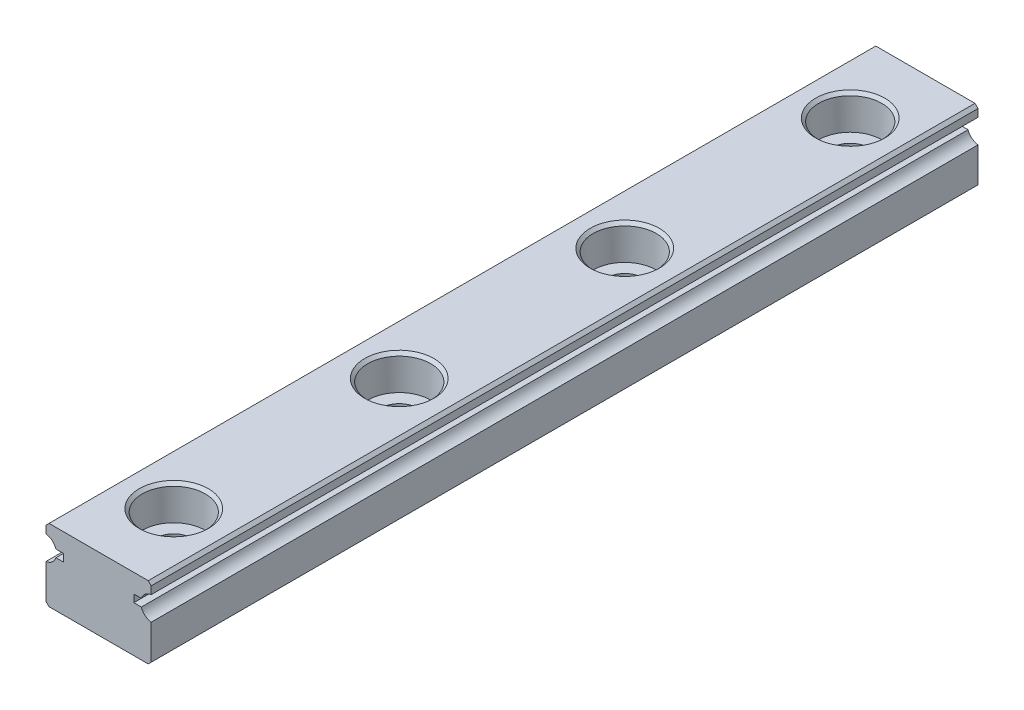
ISO-10303-21;
HEADER;
FILE_DESCRIPTION(('STEP AP214'),'2;1');
FILE_NAME('part.step','',(''),(''),'','','');
FILE_SCHEMA(('AUTOMOTIVE_DESIGN { 1 0 10303 214 1 1 1 1 }'));
ENDSEC;
DATA;
#1=APPLICATION_CONTEXT('core data for automotive mechanical design processes');
#2=APPLICATION_PROTOCOL_DEFINITION('international standard','automotive_design',2000,#1);
#3=PRODUCT_CONTEXT('',#1,'mechanical');
#4=PRODUCT('Part','Part','',(#3));
#5=PRODUCT_RELATED_PRODUCT_CATEGORY('part','',(#4));
#6=PRODUCT_DEFINITION_FORMATION('','',#4);
#7=PRODUCT_DEFINITION_CONTEXT('part definition',#1,'design');
#8=PRODUCT_DEFINITION('design','',#6,#7);
#9=PRODUCT_DEFINITION_SHAPE('','',#8);
#10=(LENGTH_UNIT() NAMED_UNIT(*) SI_UNIT(.MILLI.,.METRE.));
#11=(NAMED_UNIT(*) PLANE_ANGLE_UNIT() SI_UNIT($,.RADIAN.));
#12=(NAMED_UNIT(*) SI_UNIT($,.STERADIAN.) SOLID_ANGLE_UNIT());
#13=UNCERTAINTY_MEASURE_WITH_UNIT(LENGTH_MEASURE(1.E-05),#10,'distance_accuracy_value','');
#14=(GEOMETRIC_REPRESENTATION_CONTEXT(3) GLOBAL_UNCERTAINTY_ASSIGNED_CONTEXT((#13)) GLOBAL_UNIT_ASSIGNED_CONTEXT((#10,
#11,#12)) REPRESENTATION_CONTEXT('',''));
#15=CARTESIAN_POINT('',(0.,0.,0.));
#16=DIRECTION('',(0.,0.,1.));
#17=DIRECTION('',(1.,0.,0.));
#18=AXIS2_PLACEMENT_3D('',#15,#16,#17);
#19=CARTESIAN_POINT('',(0.,-2.401,50.));
#20=DIRECTION('',(0.,1.,0.));
#21=DIRECTION('',(0.,0.,1.));
#22=AXIS2_PLACEMENT_3D('',#19,#20,#21);
#23=CYLINDRICAL_SURFACE('',#22,1.2);
#24=CARTESIAN_POINT('',(0.,-2.2,50.));
#25=DIRECTION('',(0.,1.,0.));
#26=DIRECTION('',(0.,0.,1.));
#27=AXIS2_PLACEMENT_3D('',#24,#25,#26);
#28=CIRCLE('',#27,1.2);
#29=CARTESIAN_POINT('',(0.,-2.2,51.2));
#30=VERTEX_POINT('',#29);
#31=EDGE_CURVE('E332',#30,#30,#28,.F.);
#32=ORIENTED_EDGE('',*,*,#31,.T.);
#33=EDGE_LOOP('',(#32));
#34=FACE_BOUND('',#33,.T.);
#35=CARTESIAN_POINT('',(0.,0.0999999999999994,50.));
#36=DIRECTION('',(0.,1.,0.));
#37=DIRECTION('',(0.,0.,1.));
#38=AXIS2_PLACEMENT_3D('',#35,#36,#37);
#39=CIRCLE('',#38,1.2);
#40=CARTESIAN_POINT('',(0.,0.0999999999999994,51.2));
#41=VERTEX_POINT('',#40);
#42=EDGE_CURVE('E628',#41,#41,#39,.T.);
#43=ORIENTED_EDGE('',*,*,#42,.T.);
#44=EDGE_LOOP('',(#43));
#45=FACE_BOUND('',#44,.T.);
#46=ADVANCED_FACE('F36',(#34,#45),#23,.F.);
#47=CARTESIAN_POINT('',(0.,-2.401,35.));
#48=DIRECTION('',(0.,1.,0.));
#49=DIRECTION('',(0.,0.,1.));
#50=AXIS2_PLACEMENT_3D('',#47,#48,#49);
#51=CYLINDRICAL_SURFACE('',#50,1.2);
#52=CARTESIAN_POINT('',(0.,-2.2,35.));
#53=DIRECTION('',(0.,1.,0.));
#54=DIRECTION('',(0.,0.,1.));
#55=AXIS2_PLACEMENT_3D('',#52,#53,#54);
#56=CIRCLE('',#55,1.2);
#57=CARTESIAN_POINT('',(0.,-2.2,36.2));
#58=VERTEX_POINT('',#57);
#59=EDGE_CURVE('E320',#58,#58,#56,.F.);
#60=ORIENTED_EDGE('',*,*,#59,.T.);
#61=EDGE_LOOP('',(#60));
#62=FACE_BOUND('',#61,.T.);
#63=CARTESIAN_POINT('',(0.,0.0999999999999994,35.));
#64=DIRECTION('',(0.,1.,0.));
#65=DIRECTION('',(0.,0.,1.));
#66=AXIS2_PLACEMENT_3D('',#63,#64,#65);
#67=CIRCLE('',#66,1.2);
#68=CARTESIAN_POINT('',(0.,0.0999999999999994,36.2));
#69=VERTEX_POINT('',#68);
#70=EDGE_CURVE('E503',#69,#69,#67,.T.);
#71=ORIENTED_EDGE('',*,*,#70,.T.);
#72=EDGE_LOOP('',(#71));
#73=FACE_BOUND('',#72,.T.);
#74=ADVANCED_FACE('F353',(#62,#73),#51,.F.);
#75=CARTESIAN_POINT('',(0.,-2.401,20.));
#76=DIRECTION('',(0.,1.,0.));
#77=DIRECTION('',(0.,0.,1.));
#78=AXIS2_PLACEMENT_3D('',#75,#76,#77);
#79=CYLINDRICAL_SURFACE('',#78,1.2);
#80=CARTESIAN_POINT('',(0.,-2.2,20.));
#81=DIRECTION('',(0.,1.,0.));
#82=DIRECTION('',(0.,0.,1.));
#83=AXIS2_PLACEMENT_3D('',#80,#81,#82);
#84=CIRCLE('',#83,1.2);
#85=CARTESIAN_POINT('',(0.,-2.2,21.2));
#86=VERTEX_POINT('',#85);
#87=EDGE_CURVE('E308',#86,#86,#84,.F.);
#88=ORIENTED_EDGE('',*,*,#87,.T.);
#89=EDGE_LOOP('',(#88));
#90=FACE_BOUND('',#89,.T.);
#91=CARTESIAN_POINT('',(0.,0.0999999999999994,20.));
#92=DIRECTION('',(0.,1.,0.));
#93=DIRECTION('',(0.,0.,1.));
#94=AXIS2_PLACEMENT_3D('',#91,#92,#93);
#95=CIRCLE('',#94,1.2);
#96=CARTESIAN_POINT('',(0.,0.0999999999999994,21.2));
#97=VERTEX_POINT('',#96);
#98=EDGE_CURVE('E502',#97,#97,#95,.T.);
#99=ORIENTED_EDGE('',*,*,#98,.T.);
#100=EDGE_LOOP('',(#99));
#101=FACE_BOUND('',#100,.T.);
#102=ADVANCED_FACE('F359',(#90,#101),#79,.F.);
#103=CARTESIAN_POINT('',(0.,-2.401,5.));
#104=DIRECTION('',(0.,1.,0.));
#105=DIRECTION('',(0.,0.,1.));
#106=AXIS2_PLACEMENT_3D('',#103,#104,#105);
#107=CYLINDRICAL_SURFACE('',#106,1.2);
#108=CARTESIAN_POINT('',(0.,-2.2,5.));
#109=DIRECTION('',(0.,1.,0.));
#110=DIRECTION('',(0.,0.,1.));
#111=AXIS2_PLACEMENT_3D('',#108,#109,#110);
#112=CIRCLE('',#111,1.2);
#113=CARTESIAN_POINT('',(0.,-2.2,6.2));
#114=VERTEX_POINT('',#113);
#115=EDGE_CURVE('E296',#114,#114,#112,.F.);
#116=ORIENTED_EDGE('',*,*,#115,.T.);
#117=EDGE_LOOP('',(#116));
#118=FACE_BOUND('',#117,.T.);
#119=CARTESIAN_POINT('',(0.,0.0999999999999994,5.));
#120=DIRECTION('',(0.,1.,0.));
#121=DIRECTION('',(0.,0.,1.));
#122=AXIS2_PLACEMENT_3D('',#119,#120,#121);
#123=CIRCLE('',#122,1.2);
#124=CARTESIAN_POINT('',(0.,0.0999999999999994,6.2));
#125=VERTEX_POINT('',#124);
#126=EDGE_CURVE('E515',#125,#125,#123,.T.);
#127=ORIENTED_EDGE('',*,*,#126,.T.);
#128=EDGE_LOOP('',(#127));
#129=FACE_BOUND('',#128,.T.);
#130=ADVANCED_FACE('F369',(#118,#129),#107,.F.);
#131=CARTESIAN_POINT('',(-3.6,0.899999999999999,55.));
#132=DIRECTION('',(0.,0.,-1.));
#133=DIRECTION('',(-1.,0.,0.));
#134=AXIS2_PLACEMENT_3D('',#131,#132,#133);
#135=CYLINDRICAL_SURFACE('',#134,0.800000000000001);
#136=CARTESIAN_POINT('',(-3.6,0.899999999999999,0.));
#137=DIRECTION('',(0.,0.,-1.));
#138=DIRECTION('',(-1.,0.,0.));
#139=AXIS2_PLACEMENT_3D('',#136,#137,#138);
#140=CIRCLE('',#139,0.800000000000001);
#141=CARTESIAN_POINT('',(-3.5,1.69372539331938,0.));
#142=VERTEX_POINT('',#141);
#143=CARTESIAN_POINT('',(-2.84006579232147,1.15,0.));
#144=VERTEX_POINT('',#143);
#145=EDGE_CURVE('E206',#142,#144,#140,.T.);
#146=ORIENTED_EDGE('',*,*,#145,.T.);
#147=DIRECTION('',(0.,0.,-1.));
#148=VECTOR('',#147,1.);
#149=CARTESIAN_POINT('',(-2.84006579232147,1.15,55.));
#150=LINE('',#149,#148);
#151=CARTESIAN_POINT('',(-2.84006579232147,1.15,55.));
#152=VERTEX_POINT('',#151);
#153=EDGE_CURVE('E294',#152,#144,#150,.T.);
#154=ORIENTED_EDGE('',*,*,#153,.F.);
#155=CARTESIAN_POINT('',(-3.6,0.899999999999999,55.));
#156=DIRECTION('',(0.,0.,-1.));
#157=DIRECTION('',(-1.,0.,0.));
#158=AXIS2_PLACEMENT_3D('',#155,#156,#157);
#159=CIRCLE('',#158,0.800000000000001);
#160=CARTESIAN_POINT('',(-3.5,1.69372539331938,55.));
#161=VERTEX_POINT('',#160);
#162=EDGE_CURVE('E245',#161,#152,#159,.T.);
#163=ORIENTED_EDGE('',*,*,#162,.F.);
#164=DIRECTION('',(0.,0.,-1.));
#165=VECTOR('',#164,1.);
#166=CARTESIAN_POINT('',(-3.5,1.69372539331938,55.));
#167=LINE('',#166,#165);
#168=EDGE_CURVE('E202',#161,#142,#167,.T.);
#169=ORIENTED_EDGE('',*,*,#168,.T.);
#170=EDGE_LOOP('',(#146,#154,#163,#169));
#171=FACE_BOUND('',#170,.T.);
#172=ADVANCED_FACE('F383',(#171),#135,.F.);
#173=CARTESIAN_POINT('',(-2.84006579232147,1.15,55.));
#174=DIRECTION('',(0.,1.,0.));
#175=DIRECTION('',(-1.,0.,0.));
#176=AXIS2_PLACEMENT_3D('',#173,#174,#175);
#177=PLANE('',#176);
#178=DIRECTION('',(1.,0.,0.));
#179=VECTOR('',#178,1.);
#180=CARTESIAN_POINT('',(-2.84006579232147,1.15,0.));
#181=LINE('',#180,#179);
#182=CARTESIAN_POINT('',(-2.34006579232147,1.15,0.));
#183=VERTEX_POINT('',#182);
#184=EDGE_CURVE('E209',#144,#183,#181,.T.);
#185=ORIENTED_EDGE('',*,*,#184,.T.);
#186=DIRECTION('',(0.,0.,-1.));
#187=VECTOR('',#186,1.);
#188=CARTESIAN_POINT('',(-2.34006579232147,1.15,55.));
#189=LINE('',#188,#187);
#190=CARTESIAN_POINT('',(-2.34006579232147,1.15,55.));
#191=VERTEX_POINT('',#190);
#192=EDGE_CURVE('E291',#191,#183,#189,.T.);
#193=ORIENTED_EDGE('',*,*,#192,.F.);
#194=DIRECTION('',(1.,0.,0.));
#195=VECTOR('',#194,1.);
#196=CARTESIAN_POINT('',(-2.84006579232147,1.15,55.));
#197=LINE('',#196,#195);
#198=EDGE_CURVE('E133',#152,#191,#197,.T.);
#199=ORIENTED_EDGE('',*,*,#198,.F.);
#200=ORIENTED_EDGE('',*,*,#153,.T.);
#201=EDGE_LOOP('',(#185,#193,#199,#200));
#202=FACE_BOUND('',#201,.T.);
#203=ADVANCED_FACE('F457',(#202),#177,.F.);
#204=CARTESIAN_POINT('',(-2.34006579232147,0.649999999999998,55.));
#205=DIRECTION('',(1.,0.,0.));
#206=DIRECTION('',(0.,0.,-1.));
#207=AXIS2_PLACEMENT_3D('',#204,#205,#206);
#208=PLANE('',#207);
#209=DIRECTION('',(0.,-1.,0.));
#210=VECTOR('',#209,1.);
#211=CARTESIAN_POINT('',(-2.34006579232147,0.649999999999998,0.));
#212=LINE('',#211,#210);
#213=CARTESIAN_POINT('',(-2.34006579232147,0.649999999999998,0.));
#214=VERTEX_POINT('',#213);
#215=EDGE_CURVE('E212',#183,#214,#212,.T.);
#216=ORIENTED_EDGE('',*,*,#215,.T.);
#217=DIRECTION('',(0.,0.,-1.));
#218=VECTOR('',#217,1.);
#219=CARTESIAN_POINT('',(-2.34006579232147,0.649999999999998,55.));
#220=LINE('',#219,#218);
#221=CARTESIAN_POINT('',(-2.34006579232147,0.649999999999998,55.));
#222=VERTEX_POINT('',#221);
#223=EDGE_CURVE('E288',#222,#214,#220,.T.);
#224=ORIENTED_EDGE('',*,*,#223,.F.);
#225=DIRECTION('',(0.,-1.,0.));
#226=VECTOR('',#225,1.);
#227=CARTESIAN_POINT('',(-2.34006579232147,0.649999999999998,55.));
#228=LINE('',#227,#226);
#229=EDGE_CURVE('E522',#191,#222,#228,.T.);
#230=ORIENTED_EDGE('',*,*,#229,.F.);
#231=ORIENTED_EDGE('',*,*,#192,.T.);
#232=EDGE_LOOP('',(#216,#224,#230,#231));
#233=FACE_BOUND('',#232,.T.);
#234=ADVANCED_FACE('F453',(#233),#208,.F.);
#235=CARTESIAN_POINT('',(-2.84006579232147,0.649999999999999,55.));
#236=DIRECTION('',(0.,-1.,0.));
#237=DIRECTION('',(1.,0.,0.));
#238=AXIS2_PLACEMENT_3D('',#235,#236,#237);
#239=PLANE('',#238);
#240=DIRECTION('',(-1.,0.,0.));
#241=VECTOR('',#240,1.);
#242=CARTESIAN_POINT('',(-2.84006579232147,0.649999999999999,0.));
#243=LINE('',#242,#241);
#244=CARTESIAN_POINT('',(-2.84006579232147,0.65,0.));
#245=VERTEX_POINT('',#244);
#246=EDGE_CURVE('E214',#214,#245,#243,.T.);
#247=ORIENTED_EDGE('',*,*,#246,.T.);
#248=DIRECTION('',(0.,0.,-1.));
#249=VECTOR('',#248,1.);
#250=CARTESIAN_POINT('',(-2.84006579232147,0.65,55.));
#251=LINE('',#250,#249);
#252=CARTESIAN_POINT('',(-2.84006579232147,0.65,55.));
#253=VERTEX_POINT('',#252);
#254=EDGE_CURVE('E285',#253,#245,#251,.T.);
#255=ORIENTED_EDGE('',*,*,#254,.F.);
#256=DIRECTION('',(-1.,0.,0.));
#257=VECTOR('',#256,1.);
#258=CARTESIAN_POINT('',(-2.84006579232147,0.649999999999999,55.));
#259=LINE('',#258,#257);
#260=EDGE_CURVE('E524',#222,#253,#259,.T.);
#261=ORIENTED_EDGE('',*,*,#260,.F.);
#262=ORIENTED_EDGE('',*,*,#223,.T.);
#263=EDGE_LOOP('',(#247,#255,#261,#262));
#264=FACE_BOUND('',#263,.T.);
#265=ADVANCED_FACE('F449',(#264),#239,.F.);
#266=CARTESIAN_POINT('',(-3.6,0.899999999999999,55.));
#267=DIRECTION('',(0.,0.,-1.));
#268=DIRECTION('',(-1.,0.,0.));
#269=AXIS2_PLACEMENT_3D('',#266,#267,#268);
#270=CYLINDRICAL_SURFACE('',#269,0.800000000000001);
#271=CARTESIAN_POINT('',(-3.6,0.899999999999999,0.));
#272=DIRECTION('',(0.,0.,-1.));
#273=DIRECTION('',(-1.,0.,0.));
#274=AXIS2_PLACEMENT_3D('',#271,#272,#273);
#275=CIRCLE('',#274,0.800000000000001);
#276=CARTESIAN_POINT('',(-3.5,0.106274606680622,0.));
#277=VERTEX_POINT('',#276);
#278=EDGE_CURVE('E216',#245,#277,#275,.T.);
#279=ORIENTED_EDGE('',*,*,#278,.T.);
#280=DIRECTION('',(0.,0.,-1.));
#281=VECTOR('',#280,1.);
#282=CARTESIAN_POINT('',(-3.5,0.106274606680622,55.));
#283=LINE('',#282,#281);
#284=CARTESIAN_POINT('',(-3.5,0.106274606680622,55.));
#285=VERTEX_POINT('',#284);
#286=EDGE_CURVE('E282',#285,#277,#283,.T.);
#287=ORIENTED_EDGE('',*,*,#286,.F.);
#288=CARTESIAN_POINT('',(-3.6,0.899999999999999,55.));
#289=DIRECTION('',(0.,0.,-1.));
#290=DIRECTION('',(-1.,0.,0.));
#291=AXIS2_PLACEMENT_3D('',#288,#289,#290);
#292=CIRCLE('',#291,0.800000000000001);
#293=EDGE_CURVE('E526',#253,#285,#292,.T.);
#294=ORIENTED_EDGE('',*,*,#293,.F.);
#295=ORIENTED_EDGE('',*,*,#254,.T.);
#296=EDGE_LOOP('',(#279,#287,#294,#295));
#297=FACE_BOUND('',#296,.T.);
#298=ADVANCED_FACE('F445',(#297),#270,.F.);
#299=CARTESIAN_POINT('',(-3.5,-2.2,55.));
#300=DIRECTION('',(1.,0.,0.));
#301=DIRECTION('',(0.,1.,0.));
#302=AXIS2_PLACEMENT_3D('',#299,#300,#301);
#303=PLANE('',#302);
#304=DIRECTION('',(0.,-1.,0.));
#305=VECTOR('',#304,1.);
#306=CARTESIAN_POINT('',(-3.5,-2.2,0.));
#307=LINE('',#306,#305);
#308=CARTESIAN_POINT('',(-3.5,-2.2,0.));
#309=VERTEX_POINT('',#308);
#310=EDGE_CURVE('E218',#277,#309,#307,.T.);
#311=ORIENTED_EDGE('',*,*,#310,.T.);
#312=DIRECTION('',(0.,0.,-1.));
#313=VECTOR('',#312,1.);
#314=CARTESIAN_POINT('',(-3.5,-2.2,55.));
#315=LINE('',#314,#313);
#316=CARTESIAN_POINT('',(-3.5,-2.2,55.));
#317=VERTEX_POINT('',#316);
#318=EDGE_CURVE('E279',#317,#309,#315,.T.);
#319=ORIENTED_EDGE('',*,*,#318,.F.);
#320=DIRECTION('',(0.,-1.,0.));
#321=VECTOR('',#320,1.);
#322=CARTESIAN_POINT('',(-3.5,-2.2,55.));
#323=LINE('',#322,#321);
#324=EDGE_CURVE('E528',#285,#317,#323,.T.);
#325=ORIENTED_EDGE('',*,*,#324,.F.);
#326=ORIENTED_EDGE('',*,*,#286,.T.);
#327=EDGE_LOOP('',(#311,#319,#325,#326));
#328=FACE_BOUND('',#327,.T.);
#329=ADVANCED_FACE('F441',(#328),#303,.F.);
#330=CARTESIAN_POINT('',(-3.5,-2.2,55.));
#331=DIRECTION('',(0.707106781186548,0.707106781186548,0.));
#332=DIRECTION('',(-0.707106781186548,0.707106781186548,0.));
#333=AXIS2_PLACEMENT_3D('',#330,#331,#332);
#334=PLANE('',#333);
#335=DIRECTION('',(0.707106781186548,-0.707106781186548,0.));
#336=VECTOR('',#335,1.);
#337=CARTESIAN_POINT('',(-3.5,-2.2,0.));
#338=LINE('',#337,#336);
#339=CARTESIAN_POINT('',(-3.3,-2.4,0.));
#340=VERTEX_POINT('',#339);
#341=EDGE_CURVE('E220',#309,#340,#338,.T.);
#342=ORIENTED_EDGE('',*,*,#341,.T.);
#343=DIRECTION('',(0.,0.,-1.));
#344=VECTOR('',#343,1.);
#345=CARTESIAN_POINT('',(-3.3,-2.4,55.));
#346=LINE('',#345,#344);
#347=CARTESIAN_POINT('',(-3.3,-2.4,55.));
#348=VERTEX_POINT('',#347);
#349=EDGE_CURVE('E276',#348,#340,#346,.T.);
#350=ORIENTED_EDGE('',*,*,#349,.F.);
#351=DIRECTION('',(0.707106781186548,-0.707106781186548,0.));
#352=VECTOR('',#351,1.);
#353=CARTESIAN_POINT('',(-3.5,-2.2,55.));
#354=LINE('',#353,#352);
#355=EDGE_CURVE('E530',#317,#348,#354,.T.);
#356=ORIENTED_EDGE('',*,*,#355,.F.);
#357=ORIENTED_EDGE('',*,*,#318,.T.);
#358=EDGE_LOOP('',(#342,#350,#356,#357));
#359=FACE_BOUND('',#358,.T.);
#360=ADVANCED_FACE('F437',(#359),#334,.F.);
#361=CARTESIAN_POINT('',(-3.3,-2.4,55.));
#362=DIRECTION('',(0.,1.,0.));
#363=DIRECTION('',(0.,0.,1.));
#364=AXIS2_PLACEMENT_3D('',#361,#362,#363);
#365=PLANE('',#364);
#366=CARTESIAN_POINT('',(0.,-2.4,50.));
#367=DIRECTION('',(0.,1.,0.));
#368=DIRECTION('',(0.,0.,1.));
#369=AXIS2_PLACEMENT_3D('',#366,#367,#368);
#370=CIRCLE('',#369,1.4);
#371=CARTESIAN_POINT('',(0.,-2.4,51.4));
#372=VERTEX_POINT('',#371);
#373=EDGE_CURVE('E335',#372,#372,#370,.T.);
#374=ORIENTED_EDGE('',*,*,#373,.T.);
#375=EDGE_LOOP('',(#374));
#376=FACE_BOUND('',#375,.T.);
#377=CARTESIAN_POINT('',(0.,-2.4,35.));
#378=DIRECTION('',(0.,1.,0.));
#379=DIRECTION('',(0.,0.,1.));
#380=AXIS2_PLACEMENT_3D('',#377,#378,#379);
#381=CIRCLE('',#380,1.4);
#382=CARTESIAN_POINT('',(0.,-2.4,36.4));
#383=VERTEX_POINT('',#382);
#384=EDGE_CURVE('E323',#383,#383,#381,.T.);
#385=ORIENTED_EDGE('',*,*,#384,.T.);
#386=EDGE_LOOP('',(#385));
#387=FACE_BOUND('',#386,.T.);
#388=CARTESIAN_POINT('',(0.,-2.4,20.));
#389=DIRECTION('',(0.,1.,0.));
#390=DIRECTION('',(0.,0.,1.));
#391=AXIS2_PLACEMENT_3D('',#388,#389,#390);
#392=CIRCLE('',#391,1.4);
#393=CARTESIAN_POINT('',(0.,-2.4,21.4));
#394=VERTEX_POINT('',#393);
#395=EDGE_CURVE('E311',#394,#394,#392,.T.);
#396=ORIENTED_EDGE('',*,*,#395,.T.);
#397=EDGE_LOOP('',(#396));
#398=FACE_BOUND('',#397,.T.);
#399=CARTESIAN_POINT('',(0.,-2.4,5.));
#400=DIRECTION('',(0.,1.,0.));
#401=DIRECTION('',(0.,0.,1.));
#402=AXIS2_PLACEMENT_3D('',#399,#400,#401);
#403=CIRCLE('',#402,1.4);
#404=CARTESIAN_POINT('',(0.,-2.4,6.4));
#405=VERTEX_POINT('',#404);
#406=EDGE_CURVE('E299',#405,#405,#403,.T.);
#407=ORIENTED_EDGE('',*,*,#406,.T.);
#408=EDGE_LOOP('',(#407));
#409=FACE_BOUND('',#408,.T.);
#410=DIRECTION('',(1.,0.,0.));
#411=VECTOR('',#410,1.);
#412=CARTESIAN_POINT('',(-3.3,-2.4,0.));
#413=LINE('',#412,#411);
#414=CARTESIAN_POINT('',(3.3,-2.4,0.));
#415=VERTEX_POINT('',#414);
#416=EDGE_CURVE('E222',#340,#415,#413,.T.);
#417=ORIENTED_EDGE('',*,*,#416,.T.);
#418=DIRECTION('',(0.,0.,-1.));
#419=VECTOR('',#418,1.);
#420=CARTESIAN_POINT('',(3.3,-2.4,55.));
#421=LINE('',#420,#419);
#422=CARTESIAN_POINT('',(3.3,-2.4,55.));
#423=VERTEX_POINT('',#422);
#424=EDGE_CURVE('E273',#423,#415,#421,.T.);
#425=ORIENTED_EDGE('',*,*,#424,.F.);
#426=DIRECTION('',(1.,0.,0.));
#427=VECTOR('',#426,1.);
#428=CARTESIAN_POINT('',(-3.3,-2.4,55.));
#429=LINE('',#428,#427);
#430=EDGE_CURVE('E532',#348,#423,#429,.T.);
#431=ORIENTED_EDGE('',*,*,#430,.F.);
#432=ORIENTED_EDGE('',*,*,#349,.T.);
#433=EDGE_LOOP('',(#417,#425,#431,#432));
#434=FACE_BOUND('',#433,.T.);
#435=ADVANCED_FACE('F433',(#376,#387,#398,#409,#434),#365,.F.);
#436=CARTESIAN_POINT('',(3.3,-2.4,55.));
#437=DIRECTION('',(-0.707106781186548,0.707106781186548,0.));
#438=DIRECTION('',(-0.707106781186548,-0.707106781186548,0.));
#439=AXIS2_PLACEMENT_3D('',#436,#437,#438);
#440=PLANE('',#439);
#441=DIRECTION('',(0.707106781186548,0.707106781186548,0.));
#442=VECTOR('',#441,1.);
#443=CARTESIAN_POINT('',(3.3,-2.4,0.));
#444=LINE('',#443,#442);
#445=CARTESIAN_POINT('',(3.5,-2.2,0.));
#446=VERTEX_POINT('',#445);
#447=EDGE_CURVE('E224',#415,#446,#444,.T.);
#448=ORIENTED_EDGE('',*,*,#447,.T.);
#449=DIRECTION('',(0.,0.,-1.));
#450=VECTOR('',#449,1.);
#451=CARTESIAN_POINT('',(3.5,-2.2,55.));
#452=LINE('',#451,#450);
#453=CARTESIAN_POINT('',(3.5,-2.2,55.));
#454=VERTEX_POINT('',#453);
#455=EDGE_CURVE('E270',#454,#446,#452,.T.);
#456=ORIENTED_EDGE('',*,*,#455,.F.);
#457=DIRECTION('',(0.707106781186548,0.707106781186548,0.));
#458=VECTOR('',#457,1.);
#459=CARTESIAN_POINT('',(3.3,-2.4,55.));
#460=LINE('',#459,#458);
#461=EDGE_CURVE('E534',#423,#454,#460,.T.);
#462=ORIENTED_EDGE('',*,*,#461,.F.);
#463=ORIENTED_EDGE('',*,*,#424,.T.);
#464=EDGE_LOOP('',(#448,#456,#462,#463));
#465=FACE_BOUND('',#464,.T.);
#466=ADVANCED_FACE('F429',(#465),#440,.F.);
#467=CARTESIAN_POINT('',(3.5,-2.2,55.));
#468=DIRECTION('',(-1.,0.,0.));
#469=DIRECTION('',(0.,-1.,0.));
#470=AXIS2_PLACEMENT_3D('',#467,#468,#469);
#471=PLANE('',#470);
#472=DIRECTION('',(0.,1.,0.));
#473=VECTOR('',#472,1.);
#474=CARTESIAN_POINT('',(3.5,-2.2,0.));
#475=LINE('',#474,#473);
#476=CARTESIAN_POINT('',(3.5,0.106274606680621,0.));
#477=VERTEX_POINT('',#476);
#478=EDGE_CURVE('E226',#446,#477,#475,.T.);
#479=ORIENTED_EDGE('',*,*,#478,.T.);
#480=DIRECTION('',(0.,0.,-1.));
#481=VECTOR('',#480,1.);
#482=CARTESIAN_POINT('',(3.5,0.106274606680621,55.));
#483=LINE('',#482,#481);
#484=CARTESIAN_POINT('',(3.5,0.106274606680621,55.));
#485=VERTEX_POINT('',#484);
#486=EDGE_CURVE('E267',#485,#477,#483,.T.);
#487=ORIENTED_EDGE('',*,*,#486,.F.);
#488=DIRECTION('',(0.,1.,0.));
#489=VECTOR('',#488,1.);
#490=CARTESIAN_POINT('',(3.5,-2.2,55.));
#491=LINE('',#490,#489);
#492=EDGE_CURVE('E536',#454,#485,#491,.T.);
#493=ORIENTED_EDGE('',*,*,#492,.F.);
#494=ORIENTED_EDGE('',*,*,#455,.T.);
#495=EDGE_LOOP('',(#479,#487,#493,#494));
#496=FACE_BOUND('',#495,.T.);
#497=ADVANCED_FACE('F425',(#496),#471,.F.);
#498=CARTESIAN_POINT('',(3.6,0.899999999999999,55.));
#499=DIRECTION('',(0.,0.,-1.));
#500=DIRECTION('',(-1.,0.,0.));
#501=AXIS2_PLACEMENT_3D('',#498,#499,#500);
#502=CYLINDRICAL_SURFACE('',#501,0.800000000000001);
#503=CARTESIAN_POINT('',(3.6,0.899999999999999,0.));
#504=DIRECTION('',(0.,0.,-1.));
#505=DIRECTION('',(1.,0.,0.));
#506=AXIS2_PLACEMENT_3D('',#503,#504,#505);
#507=CIRCLE('',#506,0.800000000000001);
#508=CARTESIAN_POINT('',(2.84006579232146,0.649999999999999,0.));
#509=VERTEX_POINT('',#508);
#510=EDGE_CURVE('E228',#477,#509,#507,.T.);
#511=ORIENTED_EDGE('',*,*,#510,.T.);
#512=DIRECTION('',(0.,0.,-1.));
#513=VECTOR('',#512,1.);
#514=CARTESIAN_POINT('',(2.84006579232146,0.649999999999999,55.));
#515=LINE('',#514,#513);
#516=CARTESIAN_POINT('',(2.84006579232146,0.649999999999999,55.));
#517=VERTEX_POINT('',#516);
#518=EDGE_CURVE('E264',#517,#509,#515,.T.);
#519=ORIENTED_EDGE('',*,*,#518,.F.);
#520=CARTESIAN_POINT('',(3.6,0.899999999999999,55.));
#521=DIRECTION('',(0.,0.,-1.));
#522=DIRECTION('',(1.,0.,0.));
#523=AXIS2_PLACEMENT_3D('',#520,#521,#522);
#524=CIRCLE('',#523,0.800000000000001);
#525=EDGE_CURVE('E538',#485,#517,#524,.T.);
#526=ORIENTED_EDGE('',*,*,#525,.F.);
#527=ORIENTED_EDGE('',*,*,#486,.T.);
#528=EDGE_LOOP('',(#511,#519,#526,#527));
#529=FACE_BOUND('',#528,.T.);
#530=ADVANCED_FACE('F421',(#529),#502,.F.);
#531=CARTESIAN_POINT('',(2.84006579232146,0.649999999999999,55.));
#532=DIRECTION('',(0.,-1.,0.));
#533=DIRECTION('',(1.,0.,0.));
#534=AXIS2_PLACEMENT_3D('',#531,#532,#533);
#535=PLANE('',#534);
#536=DIRECTION('',(-1.,0.,0.));
#537=VECTOR('',#536,1.);
#538=CARTESIAN_POINT('',(2.84006579232146,0.649999999999999,0.));
#539=LINE('',#538,#537);
#540=CARTESIAN_POINT('',(2.34006579232147,0.649999999999998,0.));
#541=VERTEX_POINT('',#540);
#542=EDGE_CURVE('E230',#509,#541,#539,.T.);
#543=ORIENTED_EDGE('',*,*,#542,.T.);
#544=DIRECTION('',(0.,0.,-1.));
#545=VECTOR('',#544,1.);
#546=CARTESIAN_POINT('',(2.34006579232147,0.649999999999998,55.));
#547=LINE('',#546,#545);
#548=CARTESIAN_POINT('',(2.34006579232147,0.649999999999998,55.));
#549=VERTEX_POINT('',#548);
#550=EDGE_CURVE('E261',#549,#541,#547,.T.);
#551=ORIENTED_EDGE('',*,*,#550,.F.);
#552=DIRECTION('',(-1.,0.,0.));
#553=VECTOR('',#552,1.);
#554=CARTESIAN_POINT('',(2.84006579232146,0.649999999999999,55.));
#555=LINE('',#554,#553);
#556=EDGE_CURVE('E540',#517,#549,#555,.T.);
#557=ORIENTED_EDGE('',*,*,#556,.F.);
#558=ORIENTED_EDGE('',*,*,#518,.T.);
#559=EDGE_LOOP('',(#543,#551,#557,#558));
#560=FACE_BOUND('',#559,.T.);
#561=ADVANCED_FACE('F417',(#560),#535,.F.);
#562=CARTESIAN_POINT('',(2.34006579232147,0.649999999999998,55.));
#563=DIRECTION('',(-1.,0.,0.));
#564=DIRECTION('',(0.,0.,1.));
#565=AXIS2_PLACEMENT_3D('',#562,#563,#564);
#566=PLANE('',#565);
#567=DIRECTION('',(0.,1.,0.));
#568=VECTOR('',#567,1.);
#569=CARTESIAN_POINT('',(2.34006579232147,0.649999999999998,0.));
#570=LINE('',#569,#568);
#571=CARTESIAN_POINT('',(2.34006579232147,1.15,0.));
#572=VERTEX_POINT('',#571);
#573=EDGE_CURVE('E232',#541,#572,#570,.T.);
#574=ORIENTED_EDGE('',*,*,#573,.T.);
#575=DIRECTION('',(0.,0.,-1.));
#576=VECTOR('',#575,1.);
#577=CARTESIAN_POINT('',(2.34006579232147,1.15,55.));
#578=LINE('',#577,#576);
#579=CARTESIAN_POINT('',(2.34006579232147,1.15,55.));
#580=VERTEX_POINT('',#579);
#581=EDGE_CURVE('E258',#580,#572,#578,.T.);
#582=ORIENTED_EDGE('',*,*,#581,.F.);
#583=DIRECTION('',(0.,1.,0.));
#584=VECTOR('',#583,1.);
#585=CARTESIAN_POINT('',(2.34006579232147,0.649999999999998,55.));
#586=LINE('',#585,#584);
#587=EDGE_CURVE('E542',#549,#580,#586,.T.);
#588=ORIENTED_EDGE('',*,*,#587,.F.);
#589=ORIENTED_EDGE('',*,*,#550,.T.);
#590=EDGE_LOOP('',(#574,#582,#588,#589));
#591=FACE_BOUND('',#590,.T.);
#592=ADVANCED_FACE('F413',(#591),#566,.F.);
#593=CARTESIAN_POINT('',(2.84006579232146,1.15,55.));
#594=DIRECTION('',(0.,1.,0.));
#595=DIRECTION('',(-1.,0.,0.));
#596=AXIS2_PLACEMENT_3D('',#593,#594,#595);
#597=PLANE('',#596);
#598=DIRECTION('',(1.,0.,0.));
#599=VECTOR('',#598,1.);
#600=CARTESIAN_POINT('',(2.84006579232146,1.15,0.));
#601=LINE('',#600,#599);
#602=CARTESIAN_POINT('',(2.84006579232147,1.15,0.));
#603=VERTEX_POINT('',#602);
#604=EDGE_CURVE('E234',#572,#603,#601,.T.);
#605=ORIENTED_EDGE('',*,*,#604,.T.);
#606=DIRECTION('',(0.,0.,-1.));
#607=VECTOR('',#606,1.);
#608=CARTESIAN_POINT('',(2.84006579232147,1.15,55.));
#609=LINE('',#608,#607);
#610=CARTESIAN_POINT('',(2.84006579232147,1.15,55.));
#611=VERTEX_POINT('',#610);
#612=EDGE_CURVE('E255',#611,#603,#609,.T.);
#613=ORIENTED_EDGE('',*,*,#612,.F.);
#614=DIRECTION('',(1.,0.,0.));
#615=VECTOR('',#614,1.);
#616=CARTESIAN_POINT('',(2.84006579232146,1.15,55.));
#617=LINE('',#616,#615);
#618=EDGE_CURVE('E544',#580,#611,#617,.T.);
#619=ORIENTED_EDGE('',*,*,#618,.F.);
#620=ORIENTED_EDGE('',*,*,#581,.T.);
#621=EDGE_LOOP('',(#605,#613,#619,#620));
#622=FACE_BOUND('',#621,.T.);
#623=ADVANCED_FACE('F409',(#622),#597,.F.);
#624=CARTESIAN_POINT('',(3.6,0.899999999999999,55.));
#625=DIRECTION('',(0.,0.,-1.));
#626=DIRECTION('',(-1.,0.,0.));
#627=AXIS2_PLACEMENT_3D('',#624,#625,#626);
#628=CYLINDRICAL_SURFACE('',#627,0.800000000000001);
#629=CARTESIAN_POINT('',(3.6,0.899999999999999,0.));
#630=DIRECTION('',(0.,0.,-1.));
#631=DIRECTION('',(1.,0.,0.));
#632=AXIS2_PLACEMENT_3D('',#629,#630,#631);
#633=CIRCLE('',#632,0.800000000000001);
#634=CARTESIAN_POINT('',(3.5,1.69372539331938,0.));
#635=VERTEX_POINT('',#634);
#636=EDGE_CURVE('E236',#603,#635,#633,.T.);
#637=ORIENTED_EDGE('',*,*,#636,.T.);
#638=DIRECTION('',(0.,0.,-1.));
#639=VECTOR('',#638,1.);
#640=CARTESIAN_POINT('',(3.5,1.69372539331938,55.));
#641=LINE('',#640,#639);
#642=CARTESIAN_POINT('',(3.5,1.69372539331938,55.));
#643=VERTEX_POINT('',#642);
#644=EDGE_CURVE('E252',#643,#635,#641,.T.);
#645=ORIENTED_EDGE('',*,*,#644,.F.);
#646=CARTESIAN_POINT('',(3.6,0.899999999999999,55.));
#647=DIRECTION('',(0.,0.,-1.));
#648=DIRECTION('',(1.,0.,0.));
#649=AXIS2_PLACEMENT_3D('',#646,#647,#648);
#650=CIRCLE('',#649,0.800000000000001);
#651=EDGE_CURVE('E546',#611,#643,#650,.T.);
#652=ORIENTED_EDGE('',*,*,#651,.F.);
#653=ORIENTED_EDGE('',*,*,#612,.T.);
#654=EDGE_LOOP('',(#637,#645,#652,#653));
#655=FACE_BOUND('',#654,.T.);
#656=ADVANCED_FACE('F405',(#655),#628,.F.);
#657=CARTESIAN_POINT('',(3.5,1.69372539331938,55.));
#658=DIRECTION('',(-1.,0.,0.));
#659=DIRECTION('',(0.,-1.,0.));
#660=AXIS2_PLACEMENT_3D('',#657,#658,#659);
#661=PLANE('',#660);
#662=DIRECTION('',(0.,1.,0.));
#663=VECTOR('',#662,1.);
#664=CARTESIAN_POINT('',(3.5,1.69372539331938,0.));
#665=LINE('',#664,#663);
#666=CARTESIAN_POINT('',(3.5,2.2,0.));
#667=VERTEX_POINT('',#666);
#668=EDGE_CURVE('E238',#635,#667,#665,.T.);
#669=ORIENTED_EDGE('',*,*,#668,.T.);
#670=DIRECTION('',(0.,0.,-1.));
#671=VECTOR('',#670,1.);
#672=CARTESIAN_POINT('',(3.5,2.2,55.));
#673=LINE('',#672,#671);
#674=CARTESIAN_POINT('',(3.5,2.2,55.));
#675=VERTEX_POINT('',#674);
#676=EDGE_CURVE('E249',#675,#667,#673,.T.);
#677=ORIENTED_EDGE('',*,*,#676,.F.);
#678=DIRECTION('',(0.,1.,0.));
#679=VECTOR('',#678,1.);
#680=CARTESIAN_POINT('',(3.5,1.69372539331938,55.));
#681=LINE('',#680,#679);
#682=EDGE_CURVE('E548',#643,#675,#681,.T.);
#683=ORIENTED_EDGE('',*,*,#682,.F.);
#684=ORIENTED_EDGE('',*,*,#644,.T.);
#685=EDGE_LOOP('',(#669,#677,#683,#684));
#686=FACE_BOUND('',#685,.T.);
#687=ADVANCED_FACE('F401',(#686),#661,.F.);
#688=CARTESIAN_POINT('',(3.3,2.4,55.));
#689=DIRECTION('',(-0.707106781186547,-0.707106781186548,0.));
#690=DIRECTION('',(0.707106781186548,-0.707106781186547,0.));
#691=AXIS2_PLACEMENT_3D('',#688,#689,#690);
#692=PLANE('',#691);
#693=DIRECTION('',(-0.707106781186548,0.707106781186547,0.));
#694=VECTOR('',#693,1.);
#695=CARTESIAN_POINT('',(3.3,2.4,0.));
#696=LINE('',#695,#694);
#697=CARTESIAN_POINT('',(3.3,2.4,0.));
#698=VERTEX_POINT('',#697);
#699=EDGE_CURVE('E240',#667,#698,#696,.T.);
#700=ORIENTED_EDGE('',*,*,#699,.T.);
#701=DIRECTION('',(0.,0.,-1.));
#702=VECTOR('',#701,1.);
#703=CARTESIAN_POINT('',(3.3,2.4,55.));
#704=LINE('',#703,#702);
#705=CARTESIAN_POINT('',(3.3,2.4,55.));
#706=VERTEX_POINT('',#705);
#707=EDGE_CURVE('E197',#706,#698,#704,.T.);
#708=ORIENTED_EDGE('',*,*,#707,.F.);
#709=DIRECTION('',(-0.707106781186548,0.707106781186547,0.));
#710=VECTOR('',#709,1.);
#711=CARTESIAN_POINT('',(3.3,2.4,55.));
#712=LINE('',#711,#710);
#713=EDGE_CURVE('E188',#675,#706,#712,.T.);
#714=ORIENTED_EDGE('',*,*,#713,.F.);
#715=ORIENTED_EDGE('',*,*,#676,.T.);
#716=EDGE_LOOP('',(#700,#708,#714,#715));
#717=FACE_BOUND('',#716,.T.);
#718=ADVANCED_FACE('F397',(#717),#692,.F.);
#719=CARTESIAN_POINT('',(-3.3,2.4,55.));
#720=DIRECTION('',(0.,-1.,0.));
#721=DIRECTION('',(0.,0.,-1.));
#722=AXIS2_PLACEMENT_3D('',#719,#720,#721);
#723=PLANE('',#722);
#724=CARTESIAN_POINT('',(0.,2.4,50.));
#725=DIRECTION('',(0.,-1.,0.));
#726=DIRECTION('',(0.,0.,-1.));
#727=AXIS2_PLACEMENT_3D('',#724,#725,#726);
#728=CIRCLE('',#727,2.3);
#729=CARTESIAN_POINT('',(0.,2.4,47.7));
#730=VERTEX_POINT('',#729);
#731=EDGE_CURVE('E11',#730,#730,#728,.T.);
#732=ORIENTED_EDGE('',*,*,#731,.T.);
#733=EDGE_LOOP('',(#732));
#734=FACE_BOUND('',#733,.T.);
#735=CARTESIAN_POINT('',(0.,2.4,35.));
#736=DIRECTION('',(0.,-1.,0.));
#737=DIRECTION('',(0.,0.,-1.));
#738=AXIS2_PLACEMENT_3D('',#735,#736,#737);
#739=CIRCLE('',#738,2.3);
#740=CARTESIAN_POINT('',(0.,2.4,32.7));
#741=VERTEX_POINT('',#740);
#742=EDGE_CURVE('E329',#741,#741,#739,.T.);
#743=ORIENTED_EDGE('',*,*,#742,.T.);
#744=EDGE_LOOP('',(#743));
#745=FACE_BOUND('',#744,.T.);
#746=CARTESIAN_POINT('',(0.,2.4,20.));
#747=DIRECTION('',(0.,-1.,0.));
#748=DIRECTION('',(0.,0.,-1.));
#749=AXIS2_PLACEMENT_3D('',#746,#747,#748);
#750=CIRCLE('',#749,2.3);
#751=CARTESIAN_POINT('',(0.,2.4,17.7));
#752=VERTEX_POINT('',#751);
#753=EDGE_CURVE('E317',#752,#752,#750,.T.);
#754=ORIENTED_EDGE('',*,*,#753,.T.);
#755=EDGE_LOOP('',(#754));
#756=FACE_BOUND('',#755,.T.);
#757=CARTESIAN_POINT('',(0.,2.4,5.));
#758=DIRECTION('',(0.,-1.,0.));
#759=DIRECTION('',(0.,0.,-1.));
#760=AXIS2_PLACEMENT_3D('',#757,#758,#759);
#761=CIRCLE('',#760,2.3);
#762=CARTESIAN_POINT('',(0.,2.4,2.7));
#763=VERTEX_POINT('',#762);
#764=EDGE_CURVE('E305',#763,#763,#761,.T.);
#765=ORIENTED_EDGE('',*,*,#764,.T.);
#766=EDGE_LOOP('',(#765));
#767=FACE_BOUND('',#766,.T.);
#768=DIRECTION('',(-1.,0.,0.));
#769=VECTOR('',#768,1.);
#770=CARTESIAN_POINT('',(-3.3,2.4,0.));
#771=LINE('',#770,#769);
#772=CARTESIAN_POINT('',(-3.3,2.4,0.));
#773=VERTEX_POINT('',#772);
#774=EDGE_CURVE('E196',#698,#773,#771,.T.);
#775=ORIENTED_EDGE('',*,*,#774,.T.);
#776=DIRECTION('',(0.,0.,-1.));
#777=VECTOR('',#776,1.);
#778=CARTESIAN_POINT('',(-3.3,2.4,55.));
#779=LINE('',#778,#777);
#780=CARTESIAN_POINT('',(-3.3,2.4,55.));
#781=VERTEX_POINT('',#780);
#782=EDGE_CURVE('E193',#781,#773,#779,.T.);
#783=ORIENTED_EDGE('',*,*,#782,.F.);
#784=DIRECTION('',(-1.,0.,0.));
#785=VECTOR('',#784,1.);
#786=CARTESIAN_POINT('',(-3.3,2.4,55.));
#787=LINE('',#786,#785);
#788=EDGE_CURVE('E182',#706,#781,#787,.T.);
#789=ORIENTED_EDGE('',*,*,#788,.F.);
#790=ORIENTED_EDGE('',*,*,#707,.T.);
#791=EDGE_LOOP('',(#775,#783,#789,#790));
#792=FACE_BOUND('',#791,.T.);
#793=ADVANCED_FACE('F194',(#734,#745,#756,#767,#792),#723,.F.);
#794=CARTESIAN_POINT('',(-3.5,2.2,55.));
#795=DIRECTION('',(0.707106781186548,-0.707106781186548,0.));
#796=DIRECTION('',(0.707106781186548,0.707106781186548,0.));
#797=AXIS2_PLACEMENT_3D('',#794,#795,#796);
#798=PLANE('',#797);
#799=DIRECTION('',(-0.707106781186548,-0.707106781186548,0.));
#800=VECTOR('',#799,1.);
#801=CARTESIAN_POINT('',(-3.5,2.2,0.));
#802=LINE('',#801,#800);
#803=CARTESIAN_POINT('',(-3.5,2.2,0.));
#804=VERTEX_POINT('',#803);
#805=EDGE_CURVE('E118',#773,#804,#802,.T.);
#806=ORIENTED_EDGE('',*,*,#805,.T.);
#807=DIRECTION('',(0.,0.,-1.));
#808=VECTOR('',#807,1.);
#809=CARTESIAN_POINT('',(-3.5,2.2,55.));
#810=LINE('',#809,#808);
#811=CARTESIAN_POINT('',(-3.5,2.2,55.));
#812=VERTEX_POINT('',#811);
#813=EDGE_CURVE('E198',#812,#804,#810,.T.);
#814=ORIENTED_EDGE('',*,*,#813,.F.);
#815=DIRECTION('',(-0.707106781186548,-0.707106781186548,0.));
#816=VECTOR('',#815,1.);
#817=CARTESIAN_POINT('',(-3.5,2.2,55.));
#818=LINE('',#817,#816);
#819=EDGE_CURVE('E186',#781,#812,#818,.T.);
#820=ORIENTED_EDGE('',*,*,#819,.F.);
#821=ORIENTED_EDGE('',*,*,#782,.T.);
#822=EDGE_LOOP('',(#806,#814,#820,#821));
#823=FACE_BOUND('',#822,.T.);
#824=ADVANCED_FACE('F200',(#823),#798,.F.);
#825=CARTESIAN_POINT('',(-3.5,1.69372539331938,55.));
#826=DIRECTION('',(1.,0.,0.));
#827=DIRECTION('',(0.,1.,0.));
#828=AXIS2_PLACEMENT_3D('',#825,#826,#827);
#829=PLANE('',#828);
#830=DIRECTION('',(0.,-1.,0.));
#831=VECTOR('',#830,1.);
#832=CARTESIAN_POINT('',(-3.5,1.69372539331938,0.));
#833=LINE('',#832,#831);
#834=EDGE_CURVE('E124',#804,#142,#833,.T.);
#835=ORIENTED_EDGE('',*,*,#834,.T.);
#836=ORIENTED_EDGE('',*,*,#168,.F.);
#837=DIRECTION('',(0.,-1.,0.));
#838=VECTOR('',#837,1.);
#839=CARTESIAN_POINT('',(-3.5,1.69372539331938,55.));
#840=LINE('',#839,#838);
#841=EDGE_CURVE('E53',#812,#161,#840,.T.);
#842=ORIENTED_EDGE('',*,*,#841,.F.);
#843=ORIENTED_EDGE('',*,*,#813,.T.);
#844=EDGE_LOOP('',(#835,#836,#842,#843));
#845=FACE_BOUND('',#844,.T.);
#846=ADVANCED_FACE('F387',(#845),#829,.F.);
#847=CARTESIAN_POINT('',(-3.6,0.899999999999999,55.));
#848=DIRECTION('',(0.,0.,-1.));
#849=DIRECTION('',(-1.,0.,0.));
#850=AXIS2_PLACEMENT_3D('',#847,#848,#849);
#851=PLANE('',#850);
#852=ORIENTED_EDGE('',*,*,#162,.T.);
#853=ORIENTED_EDGE('',*,*,#198,.T.);
#854=ORIENTED_EDGE('',*,*,#229,.T.);
#855=ORIENTED_EDGE('',*,*,#260,.T.);
#856=ORIENTED_EDGE('',*,*,#293,.T.);
#857=ORIENTED_EDGE('',*,*,#324,.T.);
#858=ORIENTED_EDGE('',*,*,#355,.T.);
#859=ORIENTED_EDGE('',*,*,#430,.T.);
#860=ORIENTED_EDGE('',*,*,#461,.T.);
#861=ORIENTED_EDGE('',*,*,#492,.T.);
#862=ORIENTED_EDGE('',*,*,#525,.T.);
#863=ORIENTED_EDGE('',*,*,#556,.T.);
#864=ORIENTED_EDGE('',*,*,#587,.T.);
#865=ORIENTED_EDGE('',*,*,#618,.T.);
#866=ORIENTED_EDGE('',*,*,#651,.T.);
#867=ORIENTED_EDGE('',*,*,#682,.T.);
#868=ORIENTED_EDGE('',*,*,#713,.T.);
#869=ORIENTED_EDGE('',*,*,#788,.T.);
#870=ORIENTED_EDGE('',*,*,#819,.T.);
#871=ORIENTED_EDGE('',*,*,#841,.T.);
#872=EDGE_LOOP('',(#852,#853,#854,#855,#856,#857,#858,#859,#860,#861,#862,#863,#864,#865,#866,
#867,#868,#869,#870,#871));
#873=FACE_BOUND('',#872,.T.);
#874=ADVANCED_FACE('F184',(#873),#851,.F.);
#875=CARTESIAN_POINT('',(-3.6,0.899999999999999,0.));
#876=DIRECTION('',(0.,0.,-1.));
#877=DIRECTION('',(-1.,0.,0.));
#878=AXIS2_PLACEMENT_3D('',#875,#876,#877);
#879=PLANE('',#878);
#880=ORIENTED_EDGE('',*,*,#145,.F.);
#881=ORIENTED_EDGE('',*,*,#834,.F.);
#882=ORIENTED_EDGE('',*,*,#805,.F.);
#883=ORIENTED_EDGE('',*,*,#774,.F.);
#884=ORIENTED_EDGE('',*,*,#699,.F.);
#885=ORIENTED_EDGE('',*,*,#668,.F.);
#886=ORIENTED_EDGE('',*,*,#636,.F.);
#887=ORIENTED_EDGE('',*,*,#604,.F.);
#888=ORIENTED_EDGE('',*,*,#573,.F.);
#889=ORIENTED_EDGE('',*,*,#542,.F.);
#890=ORIENTED_EDGE('',*,*,#510,.F.);
#891=ORIENTED_EDGE('',*,*,#478,.F.);
#892=ORIENTED_EDGE('',*,*,#447,.F.);
#893=ORIENTED_EDGE('',*,*,#416,.F.);
#894=ORIENTED_EDGE('',*,*,#341,.F.);
#895=ORIENTED_EDGE('',*,*,#310,.F.);
#896=ORIENTED_EDGE('',*,*,#278,.F.);
#897=ORIENTED_EDGE('',*,*,#246,.F.);
#898=ORIENTED_EDGE('',*,*,#215,.F.);
#899=ORIENTED_EDGE('',*,*,#184,.F.);
#900=EDGE_LOOP('',(#880,#881,#882,#883,#884,#885,#886,#887,#888,#889,#890,#891,#892,#893,#894,
#895,#896,#897,#898,#899));
#901=FACE_BOUND('',#900,.T.);
#902=ADVANCED_FACE('F379',(#901),#879,.T.);
#903=CARTESIAN_POINT('',(0.,0.0999999999999994,5.));
#904=DIRECTION('',(0.,1.,0.));
#905=DIRECTION('',(0.,0.,1.));
#906=AXIS2_PLACEMENT_3D('',#903,#904,#905);
#907=CYLINDRICAL_SURFACE('',#906,2.1);
#908=CARTESIAN_POINT('',(0.,2.20000000000001,5.));
#909=DIRECTION('',(0.,-1.,0.));
#910=DIRECTION('',(0.,0.,-1.));
#911=AXIS2_PLACEMENT_3D('',#908,#909,#910);
#912=CIRCLE('',#911,2.1);
#913=CARTESIAN_POINT('',(0.,2.20000000000001,2.9));
#914=VERTEX_POINT('',#913);
#915=EDGE_CURVE('E302',#914,#914,#912,.F.);
#916=ORIENTED_EDGE('',*,*,#915,.T.);
#917=EDGE_LOOP('',(#916));
#918=FACE_BOUND('',#917,.T.);
#919=CARTESIAN_POINT('',(0.,0.0999999999999994,5.));
#920=DIRECTION('',(0.,1.,0.));
#921=DIRECTION('',(0.,0.,1.));
#922=AXIS2_PLACEMENT_3D('',#919,#920,#921);
#923=CIRCLE('',#922,2.1);
#924=CARTESIAN_POINT('',(0.,0.0999999999999994,7.1));
#925=VERTEX_POINT('',#924);
#926=EDGE_CURVE('E210',#925,#925,#923,.T.);
#927=ORIENTED_EDGE('',*,*,#926,.F.);
#928=EDGE_LOOP('',(#927));
#929=FACE_BOUND('',#928,.T.);
#930=ADVANCED_FACE('F375',(#918,#929),#907,.F.);
#931=CARTESIAN_POINT('',(0.,0.0999999999999994,5.));
#932=DIRECTION('',(0.,1.,0.));
#933=DIRECTION('',(0.,0.,1.));
#934=AXIS2_PLACEMENT_3D('',#931,#932,#933);
#935=PLANE('',#934);
#936=ORIENTED_EDGE('',*,*,#126,.F.);
#937=EDGE_LOOP('',(#936));
#938=FACE_BOUND('',#937,.T.);
#939=ORIENTED_EDGE('',*,*,#926,.T.);
#940=EDGE_LOOP('',(#939));
#941=FACE_BOUND('',#940,.T.);
#942=ADVANCED_FACE('F371',(#938,#941),#935,.T.);
#943=CARTESIAN_POINT('',(0.,-2.2,5.));
#944=DIRECTION('',(0.,-1.,0.));
#945=DIRECTION('',(0.,0.,-1.));
#946=AXIS2_PLACEMENT_3D('',#943,#944,#945);
#947=CONICAL_SURFACE('',#946,1.2,0.785398163397449);
#948=ORIENTED_EDGE('',*,*,#406,.F.);
#949=EDGE_LOOP('',(#948));
#950=FACE_BOUND('',#949,.T.);
#951=ORIENTED_EDGE('',*,*,#115,.F.);
#952=EDGE_LOOP('',(#951));
#953=FACE_BOUND('',#952,.T.);
#954=ADVANCED_FACE('F374',(#950,#953),#947,.F.);
#955=CARTESIAN_POINT('',(0.,2.20000000000001,5.));
#956=DIRECTION('',(0.,1.,0.));
#957=DIRECTION('',(0.,0.,1.));
#958=AXIS2_PLACEMENT_3D('',#955,#956,#957);
#959=CONICAL_SURFACE('',#958,2.1,0.785398163397455);
#960=ORIENTED_EDGE('',*,*,#764,.F.);
#961=EDGE_LOOP('',(#960));
#962=FACE_BOUND('',#961,.T.);
#963=ORIENTED_EDGE('',*,*,#915,.F.);
#964=EDGE_LOOP('',(#963));
#965=FACE_BOUND('',#964,.T.);
#966=ADVANCED_FACE('F466',(#962,#965),#959,.F.);
#967=CARTESIAN_POINT('',(0.,0.0999999999999994,20.));
#968=DIRECTION('',(0.,1.,0.));
#969=DIRECTION('',(0.,0.,1.));
#970=AXIS2_PLACEMENT_3D('',#967,#968,#969);
#971=CYLINDRICAL_SURFACE('',#970,2.1);
#972=CARTESIAN_POINT('',(0.,2.20000000000001,20.));
#973=DIRECTION('',(0.,-1.,0.));
#974=DIRECTION('',(0.,0.,-1.));
#975=AXIS2_PLACEMENT_3D('',#972,#973,#974);
#976=CIRCLE('',#975,2.1);
#977=CARTESIAN_POINT('',(0.,2.20000000000001,17.9));
#978=VERTEX_POINT('',#977);
#979=EDGE_CURVE('E314',#978,#978,#976,.F.);
#980=ORIENTED_EDGE('',*,*,#979,.T.);
#981=EDGE_LOOP('',(#980));
#982=FACE_BOUND('',#981,.T.);
#983=CARTESIAN_POINT('',(0.,0.0999999999999994,20.));
#984=DIRECTION('',(0.,1.,0.));
#985=DIRECTION('',(0.,0.,1.));
#986=AXIS2_PLACEMENT_3D('',#983,#984,#985);
#987=CIRCLE('',#986,2.1);
#988=CARTESIAN_POINT('',(0.,0.0999999999999994,22.1));
#989=VERTEX_POINT('',#988);
#990=EDGE_CURVE('E506',#989,#989,#987,.T.);
#991=ORIENTED_EDGE('',*,*,#990,.F.);
#992=EDGE_LOOP('',(#991));
#993=FACE_BOUND('',#992,.T.);
#994=ADVANCED_FACE('F364',(#982,#993),#971,.F.);
#995=CARTESIAN_POINT('',(0.,0.0999999999999994,20.));
#996=DIRECTION('',(0.,1.,0.));
#997=DIRECTION('',(0.,0.,1.));
#998=AXIS2_PLACEMENT_3D('',#995,#996,#997);
#999=PLANE('',#998);
#1000=ORIENTED_EDGE('',*,*,#98,.F.);
#1001=EDGE_LOOP('',(#1000));
#1002=FACE_BOUND('',#1001,.T.);
#1003=ORIENTED_EDGE('',*,*,#990,.T.);
#1004=EDGE_LOOP('',(#1003));
#1005=FACE_BOUND('',#1004,.T.);
#1006=ADVANCED_FACE('F496',(#1002,#1005),#999,.T.);
#1007=CARTESIAN_POINT('',(0.,0.0999999999999994,35.));
#1008=DIRECTION('',(0.,1.,0.));
#1009=DIRECTION('',(0.,0.,1.));
#1010=AXIS2_PLACEMENT_3D('',#1007,#1008,#1009);
#1011=CYLINDRICAL_SURFACE('',#1010,2.1);
#1012=CARTESIAN_POINT('',(0.,2.20000000000001,35.));
#1013=DIRECTION('',(0.,-1.,0.));
#1014=DIRECTION('',(0.,0.,-1.));
#1015=AXIS2_PLACEMENT_3D('',#1012,#1013,#1014);
#1016=CIRCLE('',#1015,2.1);
#1017=CARTESIAN_POINT('',(0.,2.20000000000001,32.9));
#1018=VERTEX_POINT('',#1017);
#1019=EDGE_CURVE('E326',#1018,#1018,#1016,.F.);
#1020=ORIENTED_EDGE('',*,*,#1019,.T.);
#1021=EDGE_LOOP('',(#1020));
#1022=FACE_BOUND('',#1021,.T.);
#1023=CARTESIAN_POINT('',(0.,0.0999999999999994,35.));
#1024=DIRECTION('',(0.,1.,0.));
#1025=DIRECTION('',(0.,0.,1.));
#1026=AXIS2_PLACEMENT_3D('',#1023,#1024,#1025);
#1027=CIRCLE('',#1026,2.1);
#1028=CARTESIAN_POINT('',(0.,0.0999999999999994,37.1));
#1029=VERTEX_POINT('',#1028);
#1030=EDGE_CURVE('E500',#1029,#1029,#1027,.T.);
#1031=ORIENTED_EDGE('',*,*,#1030,.F.);
#1032=EDGE_LOOP('',(#1031));
#1033=FACE_BOUND('',#1032,.T.);
#1034=ADVANCED_FACE('F492',(#1022,#1033),#1011,.F.);
#1035=CARTESIAN_POINT('',(0.,0.0999999999999994,35.));
#1036=DIRECTION('',(0.,1.,0.));
#1037=DIRECTION('',(0.,0.,1.));
#1038=AXIS2_PLACEMENT_3D('',#1035,#1036,#1037);
#1039=PLANE('',#1038);
#1040=ORIENTED_EDGE('',*,*,#70,.F.);
#1041=EDGE_LOOP('',(#1040));
#1042=FACE_BOUND('',#1041,.T.);
#1043=ORIENTED_EDGE('',*,*,#1030,.T.);
#1044=EDGE_LOOP('',(#1043));
#1045=FACE_BOUND('',#1044,.T.);
#1046=ADVANCED_FACE('F495',(#1042,#1045),#1039,.T.);
#1047=CARTESIAN_POINT('',(0.,0.0999999999999994,50.));
#1048=DIRECTION('',(0.,1.,0.));
#1049=DIRECTION('',(0.,0.,1.));
#1050=AXIS2_PLACEMENT_3D('',#1047,#1048,#1049);
#1051=CYLINDRICAL_SURFACE('',#1050,2.1);
#1052=CARTESIAN_POINT('',(0.,2.20000000000001,50.));
#1053=DIRECTION('',(0.,-1.,0.));
#1054=DIRECTION('',(0.,0.,-1.));
#1055=AXIS2_PLACEMENT_3D('',#1052,#1053,#1054);
#1056=CIRCLE('',#1055,2.1);
#1057=CARTESIAN_POINT('',(0.,2.20000000000001,47.9));
#1058=VERTEX_POINT('',#1057);
#1059=EDGE_CURVE('E45',#1058,#1058,#1056,.F.);
#1060=ORIENTED_EDGE('',*,*,#1059,.T.);
#1061=EDGE_LOOP('',(#1060));
#1062=FACE_BOUND('',#1061,.T.);
#1063=CARTESIAN_POINT('',(0.,0.0999999999999994,50.));
#1064=DIRECTION('',(0.,1.,0.));
#1065=DIRECTION('',(0.,0.,1.));
#1066=AXIS2_PLACEMENT_3D('',#1063,#1064,#1065);
#1067=CIRCLE('',#1066,2.1);
#1068=CARTESIAN_POINT('',(0.,0.0999999999999994,52.1));
#1069=VERTEX_POINT('',#1068);
#1070=EDGE_CURVE('E509',#1069,#1069,#1067,.T.);
#1071=ORIENTED_EDGE('',*,*,#1070,.F.);
#1072=EDGE_LOOP('',(#1071));
#1073=FACE_BOUND('',#1072,.T.);
#1074=ADVANCED_FACE('F340',(#1062,#1073),#1051,.F.);
#1075=CARTESIAN_POINT('',(0.,0.0999999999999994,50.));
#1076=DIRECTION('',(0.,1.,0.));
#1077=DIRECTION('',(0.,0.,1.));
#1078=AXIS2_PLACEMENT_3D('',#1075,#1076,#1077);
#1079=PLANE('',#1078);
#1080=ORIENTED_EDGE('',*,*,#42,.F.);
#1081=EDGE_LOOP('',(#1080));
#1082=FACE_BOUND('',#1081,.T.);
#1083=ORIENTED_EDGE('',*,*,#1070,.T.);
#1084=EDGE_LOOP('',(#1083));
#1085=FACE_BOUND('',#1084,.T.);
#1086=ADVANCED_FACE('F475',(#1082,#1085),#1079,.T.);
#1087=CARTESIAN_POINT('',(0.,-2.2,20.));
#1088=DIRECTION('',(0.,-1.,0.));
#1089=DIRECTION('',(0.,0.,-1.));
#1090=AXIS2_PLACEMENT_3D('',#1087,#1088,#1089);
#1091=CONICAL_SURFACE('',#1090,1.2,0.785398163397449);
#1092=ORIENTED_EDGE('',*,*,#395,.F.);
#1093=EDGE_LOOP('',(#1092));
#1094=FACE_BOUND('',#1093,.T.);
#1095=ORIENTED_EDGE('',*,*,#87,.F.);
#1096=EDGE_LOOP('',(#1095));
#1097=FACE_BOUND('',#1096,.T.);
#1098=ADVANCED_FACE('F471',(#1094,#1097),#1091,.F.);
#1099=CARTESIAN_POINT('',(0.,2.20000000000001,20.));
#1100=DIRECTION('',(0.,1.,0.));
#1101=DIRECTION('',(0.,0.,1.));
#1102=AXIS2_PLACEMENT_3D('',#1099,#1100,#1101);
#1103=CONICAL_SURFACE('',#1102,2.1,0.785398163397455);
#1104=ORIENTED_EDGE('',*,*,#753,.F.);
#1105=EDGE_LOOP('',(#1104));
#1106=FACE_BOUND('',#1105,.T.);
#1107=ORIENTED_EDGE('',*,*,#979,.F.);
#1108=EDGE_LOOP('',(#1107));
#1109=FACE_BOUND('',#1108,.T.);
#1110=ADVANCED_FACE('F474',(#1106,#1109),#1103,.F.);
#1111=CARTESIAN_POINT('',(0.,-2.2,35.));
#1112=DIRECTION('',(0.,-1.,0.));
#1113=DIRECTION('',(0.,0.,-1.));
#1114=AXIS2_PLACEMENT_3D('',#1111,#1112,#1113);
#1115=CONICAL_SURFACE('',#1114,1.2,0.785398163397449);
#1116=ORIENTED_EDGE('',*,*,#384,.F.);
#1117=EDGE_LOOP('',(#1116));
#1118=FACE_BOUND('',#1117,.T.);
#1119=ORIENTED_EDGE('',*,*,#59,.F.);
#1120=EDGE_LOOP('',(#1119));
#1121=FACE_BOUND('',#1120,.T.);
#1122=ADVANCED_FACE('F479',(#1118,#1121),#1115,.F.);
#1123=CARTESIAN_POINT('',(0.,2.20000000000001,35.));
#1124=DIRECTION('',(0.,1.,0.));
#1125=DIRECTION('',(0.,0.,1.));
#1126=AXIS2_PLACEMENT_3D('',#1123,#1124,#1125);
#1127=CONICAL_SURFACE('',#1126,2.1,0.785398163397455);
#1128=ORIENTED_EDGE('',*,*,#742,.F.);
#1129=EDGE_LOOP('',(#1128));
#1130=FACE_BOUND('',#1129,.T.);
#1131=ORIENTED_EDGE('',*,*,#1019,.F.);
#1132=EDGE_LOOP('',(#1131));
#1133=FACE_BOUND('',#1132,.T.);
#1134=ADVANCED_FACE('F349',(#1130,#1133),#1127,.F.);
#1135=CARTESIAN_POINT('',(0.,-2.2,50.));
#1136=DIRECTION('',(0.,-1.,0.));
#1137=DIRECTION('',(0.,0.,-1.));
#1138=AXIS2_PLACEMENT_3D('',#1135,#1136,#1137);
#1139=CONICAL_SURFACE('',#1138,1.2,0.785398163397449);
#1140=ORIENTED_EDGE('',*,*,#373,.F.);
#1141=EDGE_LOOP('',(#1140));
#1142=FACE_BOUND('',#1141,.T.);
#1143=ORIENTED_EDGE('',*,*,#31,.F.);
#1144=EDGE_LOOP('',(#1143));
#1145=FACE_BOUND('',#1144,.T.);
#1146=ADVANCED_FACE('F344',(#1142,#1145),#1139,.F.);
#1147=CARTESIAN_POINT('',(0.,2.20000000000001,50.));
#1148=DIRECTION('',(0.,1.,0.));
#1149=DIRECTION('',(0.,0.,1.));
#1150=AXIS2_PLACEMENT_3D('',#1147,#1148,#1149);
#1151=CONICAL_SURFACE('',#1150,2.1,0.785398163397455);
#1152=ORIENTED_EDGE('',*,*,#731,.F.);
#1153=EDGE_LOOP('',(#1152));
#1154=FACE_BOUND('',#1153,.T.);
#1155=ORIENTED_EDGE('',*,*,#1059,.F.);
#1156=EDGE_LOOP('',(#1155));
#1157=FACE_BOUND('',#1156,.T.);
#1158=ADVANCED_FACE('F38',(#1154,#1157),#1151,.F.);
#1159=CLOSED_SHELL('',(#46,#74,#102,#130,#172,#203,#234,#265,#298,#329,#360,#435,#466,#497,#530,
#561,#592,#623,#656,#687,#718,#793,#824,#846,#874,#902,#930,#942,#954,#966,#994,#1006,#1034,
#1046,#1074,#1086,#1098,#1110,#1122,#1134,#1146,#1158));
#1160=MANIFOLD_SOLID_BREP('B2',#1159);
#1161=ADVANCED_BREP_SHAPE_REPRESENTATION('',(#18,#1160),#14);
#1162=SHAPE_DEFINITION_REPRESENTATION(#9,#1161);
ENDSEC;
END-ISO-10303-21;
